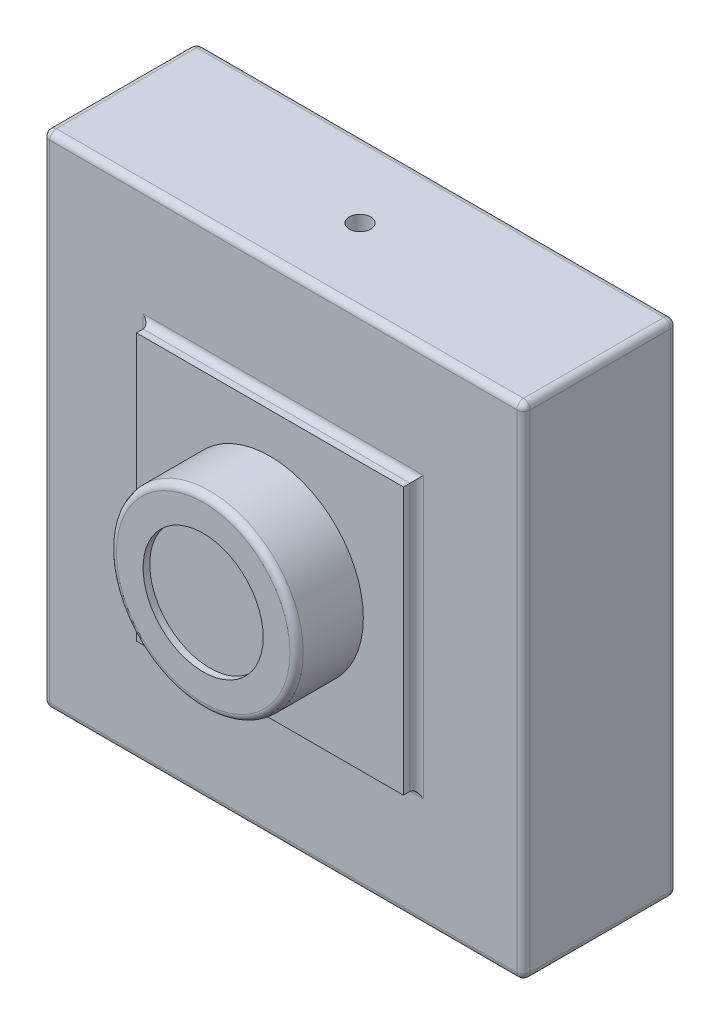
ISO-10303-21;
HEADER;
FILE_DESCRIPTION(('STEP AP214'),'2;1');
FILE_NAME('part.step','',(''),(''),'','','');
FILE_SCHEMA(('AUTOMOTIVE_DESIGN { 1 0 10303 214 1 1 1 1 }'));
ENDSEC;
DATA;
#1=APPLICATION_CONTEXT('core data for automotive mechanical design processes');
#2=APPLICATION_PROTOCOL_DEFINITION('international standard','automotive_design',2000,#1);
#3=PRODUCT_CONTEXT('',#1,'mechanical');
#4=PRODUCT('Part','Part','',(#3));
#5=PRODUCT_RELATED_PRODUCT_CATEGORY('part','',(#4));
#6=PRODUCT_DEFINITION_FORMATION('','',#4);
#7=PRODUCT_DEFINITION_CONTEXT('part definition',#1,'design');
#8=PRODUCT_DEFINITION('design','',#6,#7);
#9=PRODUCT_DEFINITION_SHAPE('','',#8);
#10=(LENGTH_UNIT() NAMED_UNIT(*) SI_UNIT(.MILLI.,.METRE.));
#11=(NAMED_UNIT(*) PLANE_ANGLE_UNIT() SI_UNIT($,.RADIAN.));
#12=(NAMED_UNIT(*) SI_UNIT($,.STERADIAN.) SOLID_ANGLE_UNIT());
#13=UNCERTAINTY_MEASURE_WITH_UNIT(LENGTH_MEASURE(1.E-05),#10,'distance_accuracy_value','');
#14=(GEOMETRIC_REPRESENTATION_CONTEXT(3) GLOBAL_UNCERTAINTY_ASSIGNED_CONTEXT((#13)) GLOBAL_UNIT_ASSIGNED_CONTEXT((#10,
#11,#12)) REPRESENTATION_CONTEXT('',''));
#15=CARTESIAN_POINT('',(0.,0.,0.));
#16=DIRECTION('',(0.,0.,1.));
#17=DIRECTION('',(1.,0.,0.));
#18=AXIS2_PLACEMENT_3D('',#15,#16,#17);
#19=CARTESIAN_POINT('',(-18.,-18.75,11.5));
#20=DIRECTION('',(1.,0.,0.));
#21=DIRECTION('',(0.,0.,-1.));
#22=AXIS2_PLACEMENT_3D('',#19,#20,#21);
#23=PLANE('',#22);
#24=DIRECTION('',(0.,-1.,0.));
#25=VECTOR('',#24,1.);
#26=CARTESIAN_POINT('',(-18.,18.75,11.));
#27=LINE('',#26,#25);
#28=CARTESIAN_POINT('',(-18.,-18.25,11.));
#29=VERTEX_POINT('',#28);
#30=CARTESIAN_POINT('',(-18.,18.25,11.));
#31=VERTEX_POINT('',#30);
#32=EDGE_CURVE('E269',#29,#31,#27,.F.);
#33=ORIENTED_EDGE('',*,*,#32,.T.);
#34=DIRECTION('',(0.,0.,-1.));
#35=VECTOR('',#34,1.);
#36=CARTESIAN_POINT('',(-18.,18.25,11.5));
#37=LINE('',#36,#35);
#38=CARTESIAN_POINT('',(-18.,18.25,0.5));
#39=VERTEX_POINT('',#38);
#40=EDGE_CURVE('E276',#31,#39,#37,.T.);
#41=ORIENTED_EDGE('',*,*,#40,.T.);
#42=DIRECTION('',(0.,-1.,0.));
#43=VECTOR('',#42,1.);
#44=CARTESIAN_POINT('',(-18.,-18.75,0.5));
#45=LINE('',#44,#43);
#46=CARTESIAN_POINT('',(-18.,-18.25,0.5));
#47=VERTEX_POINT('',#46);
#48=EDGE_CURVE('E272',#39,#47,#45,.T.);
#49=ORIENTED_EDGE('',*,*,#48,.T.);
#50=DIRECTION('',(0.,0.,-1.));
#51=VECTOR('',#50,1.);
#52=CARTESIAN_POINT('',(-18.,-18.25,11.5));
#53=LINE('',#52,#51);
#54=EDGE_CURVE('E266',#47,#29,#53,.F.);
#55=ORIENTED_EDGE('',*,*,#54,.T.);
#56=EDGE_LOOP('',(#33,#41,#49,#55));
#57=FACE_BOUND('',#56,.T.);
#58=ADVANCED_FACE('F42',(#57),#23,.F.);
#59=CARTESIAN_POINT('',(18.,-18.75,11.5));
#60=DIRECTION('',(0.,1.,0.));
#61=DIRECTION('',(-1.,0.,0.));
#62=AXIS2_PLACEMENT_3D('',#59,#60,#61);
#63=PLANE('',#62);
#64=CARTESIAN_POINT('',(0.,-18.75,5.75));
#65=DIRECTION('',(0.,-1.,0.));
#66=DIRECTION('',(0.,0.,-1.));
#67=AXIS2_PLACEMENT_3D('',#64,#65,#66);
#68=CIRCLE('',#67,0.79999999999999);
#69=CARTESIAN_POINT('',(0.,-18.75,4.95000000000001));
#70=VERTEX_POINT('',#69);
#71=EDGE_CURVE('E886',#70,#70,#68,.T.);
#72=ORIENTED_EDGE('',*,*,#71,.F.);
#73=EDGE_LOOP('',(#72));
#74=FACE_BOUND('',#73,.T.);
#75=DIRECTION('',(1.,0.,0.));
#76=VECTOR('',#75,1.);
#77=CARTESIAN_POINT('',(18.,-18.75,0.5));
#78=LINE('',#77,#76);
#79=CARTESIAN_POINT('',(-17.5,-18.75,0.5));
#80=VERTEX_POINT('',#79);
#81=CARTESIAN_POINT('',(17.5,-18.75,0.5));
#82=VERTEX_POINT('',#81);
#83=EDGE_CURVE('E220',#80,#82,#78,.T.);
#84=ORIENTED_EDGE('',*,*,#83,.T.);
#85=DIRECTION('',(0.,0.,-1.));
#86=VECTOR('',#85,1.);
#87=CARTESIAN_POINT('',(17.5,-18.75,11.5));
#88=LINE('',#87,#86);
#89=CARTESIAN_POINT('',(17.5,-18.75,11.));
#90=VERTEX_POINT('',#89);
#91=EDGE_CURVE('E224',#82,#90,#88,.F.);
#92=ORIENTED_EDGE('',*,*,#91,.T.);
#93=DIRECTION('',(1.,0.,0.));
#94=VECTOR('',#93,1.);
#95=CARTESIAN_POINT('',(-18.,-18.75,11.));
#96=LINE('',#95,#94);
#97=CARTESIAN_POINT('',(-17.5,-18.75,11.));
#98=VERTEX_POINT('',#97);
#99=EDGE_CURVE('E217',#90,#98,#96,.F.);
#100=ORIENTED_EDGE('',*,*,#99,.T.);
#101=DIRECTION('',(0.,0.,-1.));
#102=VECTOR('',#101,1.);
#103=CARTESIAN_POINT('',(-17.5,-18.75,11.5));
#104=LINE('',#103,#102);
#105=EDGE_CURVE('E214',#98,#80,#104,.T.);
#106=ORIENTED_EDGE('',*,*,#105,.T.);
#107=EDGE_LOOP('',(#84,#92,#100,#106));
#108=FACE_BOUND('',#107,.T.);
#109=ADVANCED_FACE('F451',(#74,#108),#63,.F.);
#110=CARTESIAN_POINT('',(18.,-18.75,11.5));
#111=DIRECTION('',(-1.,0.,0.));
#112=DIRECTION('',(0.,0.,1.));
#113=AXIS2_PLACEMENT_3D('',#110,#111,#112);
#114=PLANE('',#113);
#115=DIRECTION('',(0.,1.,0.));
#116=VECTOR('',#115,1.);
#117=CARTESIAN_POINT('',(18.,-18.75,0.5));
#118=LINE('',#117,#116);
#119=CARTESIAN_POINT('',(18.,-18.25,0.5));
#120=VERTEX_POINT('',#119);
#121=CARTESIAN_POINT('',(18.,18.25,0.5));
#122=VERTEX_POINT('',#121);
#123=EDGE_CURVE('E246',#120,#122,#118,.T.);
#124=ORIENTED_EDGE('',*,*,#123,.T.);
#125=DIRECTION('',(0.,0.,-1.));
#126=VECTOR('',#125,1.);
#127=CARTESIAN_POINT('',(18.,18.25,11.5));
#128=LINE('',#127,#126);
#129=CARTESIAN_POINT('',(18.,18.25,11.));
#130=VERTEX_POINT('',#129);
#131=EDGE_CURVE('E250',#122,#130,#128,.F.);
#132=ORIENTED_EDGE('',*,*,#131,.T.);
#133=DIRECTION('',(0.,1.,0.));
#134=VECTOR('',#133,1.);
#135=CARTESIAN_POINT('',(18.,-18.75,11.));
#136=LINE('',#135,#134);
#137=CARTESIAN_POINT('',(18.,-18.25,11.));
#138=VERTEX_POINT('',#137);
#139=EDGE_CURVE('E243',#130,#138,#136,.F.);
#140=ORIENTED_EDGE('',*,*,#139,.T.);
#141=DIRECTION('',(0.,0.,-1.));
#142=VECTOR('',#141,1.);
#143=CARTESIAN_POINT('',(18.,-18.25,11.5));
#144=LINE('',#143,#142);
#145=EDGE_CURVE('E240',#138,#120,#144,.T.);
#146=ORIENTED_EDGE('',*,*,#145,.T.);
#147=EDGE_LOOP('',(#124,#132,#140,#146));
#148=FACE_BOUND('',#147,.T.);
#149=ADVANCED_FACE('F459',(#148),#114,.F.);
#150=CARTESIAN_POINT('',(18.,18.75,11.5));
#151=DIRECTION('',(0.,-1.,0.));
#152=DIRECTION('',(1.,0.,0.));
#153=AXIS2_PLACEMENT_3D('',#150,#151,#152);
#154=PLANE('',#153);
#155=CARTESIAN_POINT('',(0.,18.75,5.75));
#156=DIRECTION('',(0.,1.,0.));
#157=DIRECTION('',(0.,0.,1.));
#158=AXIS2_PLACEMENT_3D('',#155,#156,#157);
#159=CIRCLE('',#158,0.79999999999999);
#160=CARTESIAN_POINT('',(0.,18.75,6.54999999999999));
#161=VERTEX_POINT('',#160);
#162=EDGE_CURVE('E883',#161,#161,#159,.T.);
#163=ORIENTED_EDGE('',*,*,#162,.F.);
#164=EDGE_LOOP('',(#163));
#165=FACE_BOUND('',#164,.T.);
#166=DIRECTION('',(-1.,0.,0.));
#167=VECTOR('',#166,1.);
#168=CARTESIAN_POINT('',(18.,18.75,0.5));
#169=LINE('',#168,#167);
#170=CARTESIAN_POINT('',(17.5,18.75,0.5));
#171=VERTEX_POINT('',#170);
#172=CARTESIAN_POINT('',(-17.5,18.75,0.5));
#173=VERTEX_POINT('',#172);
#174=EDGE_CURVE('E259',#171,#173,#169,.T.);
#175=ORIENTED_EDGE('',*,*,#174,.T.);
#176=DIRECTION('',(0.,0.,-1.));
#177=VECTOR('',#176,1.);
#178=CARTESIAN_POINT('',(-17.5,18.75,11.5));
#179=LINE('',#178,#177);
#180=CARTESIAN_POINT('',(-17.5,18.75,11.));
#181=VERTEX_POINT('',#180);
#182=EDGE_CURVE('E263',#173,#181,#179,.F.);
#183=ORIENTED_EDGE('',*,*,#182,.T.);
#184=DIRECTION('',(-1.,0.,0.));
#185=VECTOR('',#184,1.);
#186=CARTESIAN_POINT('',(18.,18.75,11.));
#187=LINE('',#186,#185);
#188=CARTESIAN_POINT('',(17.5,18.75,11.));
#189=VERTEX_POINT('',#188);
#190=EDGE_CURVE('E256',#181,#189,#187,.F.);
#191=ORIENTED_EDGE('',*,*,#190,.T.);
#192=DIRECTION('',(0.,0.,-1.));
#193=VECTOR('',#192,1.);
#194=CARTESIAN_POINT('',(17.5,18.75,11.5));
#195=LINE('',#194,#193);
#196=EDGE_CURVE('E253',#189,#171,#195,.T.);
#197=ORIENTED_EDGE('',*,*,#196,.T.);
#198=EDGE_LOOP('',(#175,#183,#191,#197));
#199=FACE_BOUND('',#198,.T.);
#200=ADVANCED_FACE('F765',(#165,#199),#154,.F.);
#201=CARTESIAN_POINT('',(0.,0.,11.5));
#202=DIRECTION('',(0.,0.,1.));
#203=DIRECTION('',(1.,0.,0.));
#204=AXIS2_PLACEMENT_3D('',#201,#202,#203);
#205=PLANE('',#204);
#206=DIRECTION('',(0.,1.,0.));
#207=VECTOR('',#206,1.);
#208=CARTESIAN_POINT('',(17.5,18.75,11.5));
#209=LINE('',#208,#207);
#210=CARTESIAN_POINT('',(17.5,-18.25,11.5));
#211=VERTEX_POINT('',#210);
#212=CARTESIAN_POINT('',(17.5,18.25,11.5));
#213=VERTEX_POINT('',#212);
#214=EDGE_CURVE('E298',#211,#213,#209,.T.);
#215=ORIENTED_EDGE('',*,*,#214,.T.);
#216=DIRECTION('',(-1.,0.,0.));
#217=VECTOR('',#216,1.);
#218=CARTESIAN_POINT('',(-18.,18.25,11.5));
#219=LINE('',#218,#217);
#220=CARTESIAN_POINT('',(-17.5,18.25,11.5));
#221=VERTEX_POINT('',#220);
#222=EDGE_CURVE('E301',#213,#221,#219,.T.);
#223=ORIENTED_EDGE('',*,*,#222,.T.);
#224=DIRECTION('',(0.,-1.,0.));
#225=VECTOR('',#224,1.);
#226=CARTESIAN_POINT('',(-17.5,-18.75,11.5));
#227=LINE('',#226,#225);
#228=CARTESIAN_POINT('',(-17.5,-18.25,11.5));
#229=VERTEX_POINT('',#228);
#230=EDGE_CURVE('E292',#221,#229,#227,.T.);
#231=ORIENTED_EDGE('',*,*,#230,.T.);
#232=DIRECTION('',(1.,0.,0.));
#233=VECTOR('',#232,1.);
#234=CARTESIAN_POINT('',(18.,-18.25,11.5));
#235=LINE('',#234,#233);
#236=EDGE_CURVE('E295',#229,#211,#235,.T.);
#237=ORIENTED_EDGE('',*,*,#236,.T.);
#238=EDGE_LOOP('',(#215,#223,#231,#237));
#239=FACE_BOUND('',#238,.T.);
#240=DIRECTION('',(0.,1.,0.));
#241=VECTOR('',#240,1.);
#242=CARTESIAN_POINT('',(10.5,0.,11.5));
#243=LINE('',#242,#241);
#244=CARTESIAN_POINT('',(10.5,10.5,11.5));
#245=VERTEX_POINT('',#244);
#246=CARTESIAN_POINT('',(10.5,-10.5,11.5));
#247=VERTEX_POINT('',#246);
#248=EDGE_CURVE('E285',#245,#247,#243,.F.);
#249=ORIENTED_EDGE('',*,*,#248,.T.);
#250=DIRECTION('',(1.,0.,0.));
#251=VECTOR('',#250,1.);
#252=CARTESIAN_POINT('',(0.,-10.5,11.5));
#253=LINE('',#252,#251);
#254=CARTESIAN_POINT('',(-10.5,-10.5,11.5));
#255=VERTEX_POINT('',#254);
#256=EDGE_CURVE('E288',#247,#255,#253,.F.);
#257=ORIENTED_EDGE('',*,*,#256,.T.);
#258=DIRECTION('',(0.,-1.,0.));
#259=VECTOR('',#258,1.);
#260=CARTESIAN_POINT('',(-10.5,0.,11.5));
#261=LINE('',#260,#259);
#262=CARTESIAN_POINT('',(-10.5,10.5,11.5));
#263=VERTEX_POINT('',#262);
#264=EDGE_CURVE('E279',#255,#263,#261,.F.);
#265=ORIENTED_EDGE('',*,*,#264,.T.);
#266=DIRECTION('',(-1.,0.,0.));
#267=VECTOR('',#266,1.);
#268=CARTESIAN_POINT('',(0.,10.5,11.5));
#269=LINE('',#268,#267);
#270=EDGE_CURVE('E282',#263,#245,#269,.F.);
#271=ORIENTED_EDGE('',*,*,#270,.T.);
#272=EDGE_LOOP('',(#249,#257,#265,#271));
#273=FACE_BOUND('',#272,.T.);
#274=ADVANCED_FACE('F423',(#239,#273),#205,.T.);
#275=CARTESIAN_POINT('',(0.,0.,0.));
#276=DIRECTION('',(0.,0.,1.));
#277=DIRECTION('',(1.,0.,0.));
#278=AXIS2_PLACEMENT_3D('',#275,#276,#277);
#279=PLANE('',#278);
#280=DIRECTION('',(0.,1.,0.));
#281=VECTOR('',#280,1.);
#282=CARTESIAN_POINT('',(17.5,0.,0.));
#283=LINE('',#282,#281);
#284=CARTESIAN_POINT('',(17.5,18.25,0.));
#285=VERTEX_POINT('',#284);
#286=CARTESIAN_POINT('',(17.5,-18.25,0.));
#287=VERTEX_POINT('',#286);
#288=EDGE_CURVE('E233',#285,#287,#283,.F.);
#289=ORIENTED_EDGE('',*,*,#288,.T.);
#290=DIRECTION('',(1.,0.,0.));
#291=VECTOR('',#290,1.);
#292=CARTESIAN_POINT('',(0.,-18.25,0.));
#293=LINE('',#292,#291);
#294=CARTESIAN_POINT('',(-17.5,-18.25,0.));
#295=VERTEX_POINT('',#294);
#296=EDGE_CURVE('E236',#287,#295,#293,.F.);
#297=ORIENTED_EDGE('',*,*,#296,.T.);
#298=DIRECTION('',(0.,-1.,0.));
#299=VECTOR('',#298,1.);
#300=CARTESIAN_POINT('',(-17.5,0.,0.));
#301=LINE('',#300,#299);
#302=CARTESIAN_POINT('',(-17.5,18.25,0.));
#303=VERTEX_POINT('',#302);
#304=EDGE_CURVE('E227',#295,#303,#301,.F.);
#305=ORIENTED_EDGE('',*,*,#304,.T.);
#306=DIRECTION('',(-1.,0.,0.));
#307=VECTOR('',#306,1.);
#308=CARTESIAN_POINT('',(0.,18.25,0.));
#309=LINE('',#308,#307);
#310=EDGE_CURVE('E230',#303,#285,#309,.F.);
#311=ORIENTED_EDGE('',*,*,#310,.T.);
#312=EDGE_LOOP('',(#289,#297,#305,#311));
#313=FACE_BOUND('',#312,.T.);
#314=ADVANCED_FACE('F791',(#313),#279,.F.);
#315=CARTESIAN_POINT('',(-10.,-10.,12.5));
#316=DIRECTION('',(1.,0.,0.));
#317=DIRECTION('',(0.,0.,-1.));
#318=AXIS2_PLACEMENT_3D('',#315,#316,#317);
#319=PLANE('',#318);
#320=DIRECTION('',(0.,0.,-1.));
#321=VECTOR('',#320,1.);
#322=CARTESIAN_POINT('',(-10.,9.99999999999999,12.5));
#323=LINE('',#322,#321);
#324=CARTESIAN_POINT('',(-10.,9.99999999999999,12.5));
#325=VERTEX_POINT('',#324);
#326=CARTESIAN_POINT('',(-10.,9.99999999999999,12.));
#327=VERTEX_POINT('',#326);
#328=EDGE_CURVE('E434',#325,#327,#323,.T.);
#329=ORIENTED_EDGE('',*,*,#328,.T.);
#330=DIRECTION('',(0.,-1.,0.));
#331=VECTOR('',#330,1.);
#332=CARTESIAN_POINT('',(-10.,-10.,12.));
#333=LINE('',#332,#331);
#334=CARTESIAN_POINT('',(-10.,-10.,12.));
#335=VERTEX_POINT('',#334);
#336=EDGE_CURVE('E11',#327,#335,#333,.T.);
#337=ORIENTED_EDGE('',*,*,#336,.T.);
#338=DIRECTION('',(0.,0.,-1.));
#339=VECTOR('',#338,1.);
#340=CARTESIAN_POINT('',(-10.,-10.,12.5));
#341=LINE('',#340,#339);
#342=CARTESIAN_POINT('',(-10.,-10.,12.5));
#343=VERTEX_POINT('',#342);
#344=EDGE_CURVE('E176',#343,#335,#341,.T.);
#345=ORIENTED_EDGE('',*,*,#344,.F.);
#346=DIRECTION('',(0.,-1.,0.));
#347=VECTOR('',#346,1.);
#348=CARTESIAN_POINT('',(-10.,-10.,12.5));
#349=LINE('',#348,#347);
#350=EDGE_CURVE('E183',#325,#343,#349,.T.);
#351=ORIENTED_EDGE('',*,*,#350,.F.);
#352=EDGE_LOOP('',(#329,#337,#345,#351));
#353=FACE_BOUND('',#352,.T.);
#354=ADVANCED_FACE('F193',(#353),#319,.F.);
#355=CARTESIAN_POINT('',(10.,-10.,12.5));
#356=DIRECTION('',(0.,1.,0.));
#357=DIRECTION('',(-1.,0.,0.));
#358=AXIS2_PLACEMENT_3D('',#355,#356,#357);
#359=PLANE('',#358);
#360=ORIENTED_EDGE('',*,*,#344,.T.);
#361=DIRECTION('',(1.,0.,0.));
#362=VECTOR('',#361,1.);
#363=CARTESIAN_POINT('',(10.,-10.,12.));
#364=LINE('',#363,#362);
#365=CARTESIAN_POINT('',(10.,-10.,12.));
#366=VERTEX_POINT('',#365);
#367=EDGE_CURVE('E305',#335,#366,#364,.T.);
#368=ORIENTED_EDGE('',*,*,#367,.T.);
#369=DIRECTION('',(0.,0.,-1.));
#370=VECTOR('',#369,1.);
#371=CARTESIAN_POINT('',(10.,-10.,12.5));
#372=LINE('',#371,#370);
#373=CARTESIAN_POINT('',(10.,-10.,12.5));
#374=VERTEX_POINT('',#373);
#375=EDGE_CURVE('E178',#374,#366,#372,.T.);
#376=ORIENTED_EDGE('',*,*,#375,.F.);
#377=DIRECTION('',(1.,0.,0.));
#378=VECTOR('',#377,1.);
#379=CARTESIAN_POINT('',(10.,-10.,12.5));
#380=LINE('',#379,#378);
#381=EDGE_CURVE('E171',#343,#374,#380,.T.);
#382=ORIENTED_EDGE('',*,*,#381,.F.);
#383=EDGE_LOOP('',(#360,#368,#376,#382));
#384=FACE_BOUND('',#383,.T.);
#385=ADVANCED_FACE('F173',(#384),#359,.F.);
#386=CARTESIAN_POINT('',(10.,-10.,12.5));
#387=DIRECTION('',(-1.,0.,0.));
#388=DIRECTION('',(0.,0.,1.));
#389=AXIS2_PLACEMENT_3D('',#386,#387,#388);
#390=PLANE('',#389);
#391=ORIENTED_EDGE('',*,*,#375,.T.);
#392=DIRECTION('',(0.,1.,0.));
#393=VECTOR('',#392,1.);
#394=CARTESIAN_POINT('',(10.,-10.,12.));
#395=LINE('',#394,#393);
#396=CARTESIAN_POINT('',(10.,10.,12.));
#397=VERTEX_POINT('',#396);
#398=EDGE_CURVE('E67',#366,#397,#395,.T.);
#399=ORIENTED_EDGE('',*,*,#398,.T.);
#400=DIRECTION('',(0.,0.,-1.));
#401=VECTOR('',#400,1.);
#402=CARTESIAN_POINT('',(10.,10.,12.5));
#403=LINE('',#402,#401);
#404=CARTESIAN_POINT('',(10.,10.,12.5));
#405=VERTEX_POINT('',#404);
#406=EDGE_CURVE('E203',#405,#397,#403,.T.);
#407=ORIENTED_EDGE('',*,*,#406,.F.);
#408=DIRECTION('',(0.,1.,0.));
#409=VECTOR('',#408,1.);
#410=CARTESIAN_POINT('',(10.,-10.,12.5));
#411=LINE('',#410,#409);
#412=EDGE_CURVE('E182',#374,#405,#411,.T.);
#413=ORIENTED_EDGE('',*,*,#412,.F.);
#414=EDGE_LOOP('',(#391,#399,#407,#413));
#415=FACE_BOUND('',#414,.T.);
#416=ADVANCED_FACE('F430',(#415),#390,.F.);
#417=CARTESIAN_POINT('',(10.,10.,12.5));
#418=DIRECTION('',(0.,-1.,0.));
#419=DIRECTION('',(1.,0.,0.));
#420=AXIS2_PLACEMENT_3D('',#417,#418,#419);
#421=PLANE('',#420);
#422=ORIENTED_EDGE('',*,*,#406,.T.);
#423=DIRECTION('',(-1.,0.,0.));
#424=VECTOR('',#423,1.);
#425=CARTESIAN_POINT('',(10.,10.,12.));
#426=LINE('',#425,#424);
#427=EDGE_CURVE('E52',#397,#327,#426,.T.);
#428=ORIENTED_EDGE('',*,*,#427,.T.);
#429=ORIENTED_EDGE('',*,*,#328,.F.);
#430=DIRECTION('',(-1.,0.,0.));
#431=VECTOR('',#430,1.);
#432=CARTESIAN_POINT('',(10.,10.,12.5));
#433=LINE('',#432,#431);
#434=EDGE_CURVE('E188',#405,#325,#433,.T.);
#435=ORIENTED_EDGE('',*,*,#434,.F.);
#436=EDGE_LOOP('',(#422,#428,#429,#435));
#437=FACE_BOUND('',#436,.T.);
#438=ADVANCED_FACE('F439',(#437),#421,.F.);
#439=CARTESIAN_POINT('',(0.,0.,12.5));
#440=DIRECTION('',(0.,0.,1.));
#441=DIRECTION('',(1.,0.,0.));
#442=AXIS2_PLACEMENT_3D('',#439,#440,#441);
#443=PLANE('',#442);
#444=CARTESIAN_POINT('',(0.,0.,12.5));
#445=DIRECTION('',(0.,0.,1.));
#446=DIRECTION('',(1.,0.,0.));
#447=AXIS2_PLACEMENT_3D('',#444,#445,#446);
#448=CIRCLE('',#447,7.);
#449=CARTESIAN_POINT('',(7.,0.,12.5));
#450=VERTEX_POINT('',#449);
#451=EDGE_CURVE('E196',#450,#450,#448,.T.);
#452=ORIENTED_EDGE('',*,*,#451,.F.);
#453=EDGE_LOOP('',(#452));
#454=FACE_BOUND('',#453,.T.);
#455=ORIENTED_EDGE('',*,*,#350,.T.);
#456=ORIENTED_EDGE('',*,*,#381,.T.);
#457=ORIENTED_EDGE('',*,*,#412,.T.);
#458=ORIENTED_EDGE('',*,*,#434,.T.);
#459=EDGE_LOOP('',(#455,#456,#457,#458));
#460=FACE_BOUND('',#459,.T.);
#461=ADVANCED_FACE('F186',(#454,#460),#443,.T.);
#462=CARTESIAN_POINT('',(0.,0.,17.5));
#463=DIRECTION('',(0.,0.,-1.));
#464=DIRECTION('',(-1.,0.,0.));
#465=AXIS2_PLACEMENT_3D('',#462,#463,#464);
#466=CYLINDRICAL_SURFACE('',#465,7.);
#467=CARTESIAN_POINT('',(0.,0.,17.));
#468=DIRECTION('',(0.,0.,1.));
#469=DIRECTION('',(1.,0.,0.));
#470=AXIS2_PLACEMENT_3D('',#467,#468,#469);
#471=CIRCLE('',#470,7.);
#472=CARTESIAN_POINT('',(7.,0.,17.));
#473=VERTEX_POINT('',#472);
#474=EDGE_CURVE('E210',#473,#473,#471,.F.);
#475=ORIENTED_EDGE('',*,*,#474,.T.);
#476=EDGE_LOOP('',(#475));
#477=FACE_BOUND('',#476,.T.);
#478=ORIENTED_EDGE('',*,*,#451,.T.);
#479=EDGE_LOOP('',(#478));
#480=FACE_BOUND('',#479,.T.);
#481=ADVANCED_FACE('F446',(#477,#480),#466,.T.);
#482=CARTESIAN_POINT('',(0.,0.,17.5));
#483=DIRECTION('',(0.,0.,1.));
#484=DIRECTION('',(1.,0.,0.));
#485=AXIS2_PLACEMENT_3D('',#482,#483,#484);
#486=PLANE('',#485);
#487=CARTESIAN_POINT('',(0.,0.,17.5));
#488=DIRECTION('',(0.,0.,1.));
#489=DIRECTION('',(1.,0.,0.));
#490=AXIS2_PLACEMENT_3D('',#487,#488,#489);
#491=CIRCLE('',#490,4.5);
#492=CARTESIAN_POINT('',(4.5,0.,17.5));
#493=VERTEX_POINT('',#492);
#494=EDGE_CURVE('E890',#493,#493,#491,.T.);
#495=ORIENTED_EDGE('',*,*,#494,.F.);
#496=EDGE_LOOP('',(#495));
#497=FACE_BOUND('',#496,.T.);
#498=CARTESIAN_POINT('',(0.,0.,17.5));
#499=DIRECTION('',(0.,0.,1.));
#500=DIRECTION('',(1.,0.,0.));
#501=AXIS2_PLACEMENT_3D('',#498,#499,#500);
#502=CIRCLE('',#501,6.5);
#503=CARTESIAN_POINT('',(6.5,0.,17.5));
#504=VERTEX_POINT('',#503);
#505=EDGE_CURVE('E201',#504,#504,#502,.T.);
#506=ORIENTED_EDGE('',*,*,#505,.T.);
#507=EDGE_LOOP('',(#506));
#508=FACE_BOUND('',#507,.T.);
#509=ADVANCED_FACE('F468',(#497,#508),#486,.T.);
#510=CARTESIAN_POINT('',(0.,0.,17.));
#511=DIRECTION('',(0.,0.,1.));
#512=DIRECTION('',(1.,0.,0.));
#513=AXIS2_PLACEMENT_3D('',#510,#511,#512);
#514=TOROIDAL_SURFACE('',#513,6.5,0.5);
#515=ORIENTED_EDGE('',*,*,#474,.F.);
#516=EDGE_LOOP('',(#515));
#517=FACE_BOUND('',#516,.T.);
#518=ORIENTED_EDGE('',*,*,#505,.F.);
#519=EDGE_LOOP('',(#518));
#520=FACE_BOUND('',#519,.T.);
#521=ADVANCED_FACE('F464',(#517,#520),#514,.T.);
#522=CARTESIAN_POINT('',(0.,18.25,11.));
#523=DIRECTION('',(1.,0.,0.));
#524=DIRECTION('',(0.,1.,0.));
#525=AXIS2_PLACEMENT_3D('',#522,#523,#524);
#526=CYLINDRICAL_SURFACE('',#525,0.5);
#527=CARTESIAN_POINT('',(-17.5,18.25,11.));
#528=DIRECTION('',(-1.,0.,0.));
#529=DIRECTION('',(0.,0.,1.));
#530=AXIS2_PLACEMENT_3D('',#527,#528,#529);
#531=CIRCLE('',#530,0.5);
#532=EDGE_CURVE('E191',#221,#181,#531,.T.);
#533=ORIENTED_EDGE('',*,*,#532,.F.);
#534=ORIENTED_EDGE('',*,*,#222,.F.);
#535=CARTESIAN_POINT('',(17.5,18.25,11.));
#536=DIRECTION('',(1.,0.,0.));
#537=DIRECTION('',(0.,0.,-1.));
#538=AXIS2_PLACEMENT_3D('',#535,#536,#537);
#539=CIRCLE('',#538,0.5);
#540=EDGE_CURVE('E395',#189,#213,#539,.T.);
#541=ORIENTED_EDGE('',*,*,#540,.F.);
#542=ORIENTED_EDGE('',*,*,#190,.F.);
#543=EDGE_LOOP('',(#533,#534,#541,#542));
#544=FACE_BOUND('',#543,.T.);
#545=ADVANCED_FACE('F467',(#544),#526,.T.);
#546=CARTESIAN_POINT('',(-17.5,18.25,11.));
#547=DIRECTION('',(0.,0.,1.));
#548=DIRECTION('',(1.,0.,0.));
#549=AXIS2_PLACEMENT_3D('',#546,#547,#548);
#550=SPHERICAL_SURFACE('',#549,0.5);
#551=CARTESIAN_POINT('',(-17.5,18.25,11.));
#552=DIRECTION('',(0.,1.,0.));
#553=DIRECTION('',(0.,0.,1.));
#554=AXIS2_PLACEMENT_3D('',#551,#552,#553);
#555=CIRCLE('',#554,0.5);
#556=EDGE_CURVE('E387',#221,#31,#555,.F.);
#557=ORIENTED_EDGE('',*,*,#556,.F.);
#558=ORIENTED_EDGE('',*,*,#532,.T.);
#559=CARTESIAN_POINT('',(-17.5,18.25,11.));
#560=DIRECTION('',(0.,0.,1.));
#561=DIRECTION('',(1.,0.,0.));
#562=AXIS2_PLACEMENT_3D('',#559,#560,#561);
#563=CIRCLE('',#562,0.5);
#564=EDGE_CURVE('E391',#31,#181,#563,.F.);
#565=ORIENTED_EDGE('',*,*,#564,.F.);
#566=EDGE_LOOP('',(#557,#558,#565));
#567=FACE_BOUND('',#566,.T.);
#568=ADVANCED_FACE('F541',(#567),#550,.T.);
#569=CARTESIAN_POINT('',(17.5,18.25,11.));
#570=DIRECTION('',(0.,0.,1.));
#571=DIRECTION('',(1.,0.,0.));
#572=AXIS2_PLACEMENT_3D('',#569,#570,#571);
#573=SPHERICAL_SURFACE('',#572,0.5);
#574=CARTESIAN_POINT('',(17.5,18.25,11.));
#575=DIRECTION('',(0.,0.,1.));
#576=DIRECTION('',(1.,0.,0.));
#577=AXIS2_PLACEMENT_3D('',#574,#575,#576);
#578=CIRCLE('',#577,0.5);
#579=EDGE_CURVE('E379',#189,#130,#578,.F.);
#580=ORIENTED_EDGE('',*,*,#579,.F.);
#581=ORIENTED_EDGE('',*,*,#540,.T.);
#582=CARTESIAN_POINT('',(17.5,18.25,11.));
#583=DIRECTION('',(0.,1.,0.));
#584=DIRECTION('',(0.,0.,1.));
#585=AXIS2_PLACEMENT_3D('',#582,#583,#584);
#586=CIRCLE('',#585,0.5);
#587=EDGE_CURVE('E383',#130,#213,#586,.F.);
#588=ORIENTED_EDGE('',*,*,#587,.F.);
#589=EDGE_LOOP('',(#580,#581,#588));
#590=FACE_BOUND('',#589,.T.);
#591=ADVANCED_FACE('F537',(#590),#573,.T.);
#592=CARTESIAN_POINT('',(-17.5,18.25,11.5));
#593=DIRECTION('',(0.,0.,-1.));
#594=DIRECTION('',(-1.,0.,0.));
#595=AXIS2_PLACEMENT_3D('',#592,#593,#594);
#596=CYLINDRICAL_SURFACE('',#595,0.5);
#597=ORIENTED_EDGE('',*,*,#564,.T.);
#598=ORIENTED_EDGE('',*,*,#182,.F.);
#599=CARTESIAN_POINT('',(-17.5,18.25,0.5));
#600=DIRECTION('',(0.,0.,-1.));
#601=DIRECTION('',(-1.,0.,0.));
#602=AXIS2_PLACEMENT_3D('',#599,#600,#601);
#603=CIRCLE('',#602,0.5);
#604=EDGE_CURVE('E372',#39,#173,#603,.T.);
#605=ORIENTED_EDGE('',*,*,#604,.F.);
#606=ORIENTED_EDGE('',*,*,#40,.F.);
#607=EDGE_LOOP('',(#597,#598,#605,#606));
#608=FACE_BOUND('',#607,.T.);
#609=ADVANCED_FACE('F533',(#608),#596,.T.);
#610=CARTESIAN_POINT('',(-17.5,0.,11.));
#611=DIRECTION('',(0.,1.,0.));
#612=DIRECTION('',(0.,0.,1.));
#613=AXIS2_PLACEMENT_3D('',#610,#611,#612);
#614=CYLINDRICAL_SURFACE('',#613,0.5);
#615=ORIENTED_EDGE('',*,*,#556,.T.);
#616=ORIENTED_EDGE('',*,*,#32,.F.);
#617=CARTESIAN_POINT('',(-17.5,-18.25,11.));
#618=DIRECTION('',(0.,-1.,0.));
#619=DIRECTION('',(0.,0.,-1.));
#620=AXIS2_PLACEMENT_3D('',#617,#618,#619);
#621=CIRCLE('',#620,0.5);
#622=EDGE_CURVE('E368',#229,#29,#621,.T.);
#623=ORIENTED_EDGE('',*,*,#622,.F.);
#624=ORIENTED_EDGE('',*,*,#230,.F.);
#625=EDGE_LOOP('',(#615,#616,#623,#624));
#626=FACE_BOUND('',#625,.T.);
#627=ADVANCED_FACE('F529',(#626),#614,.T.);
#628=CARTESIAN_POINT('',(0.,-18.25,11.));
#629=DIRECTION('',(-1.,0.,0.));
#630=DIRECTION('',(0.,-1.,0.));
#631=AXIS2_PLACEMENT_3D('',#628,#629,#630);
#632=CYLINDRICAL_SURFACE('',#631,0.5);
#633=CARTESIAN_POINT('',(17.5,-18.25,11.));
#634=DIRECTION('',(1.,0.,0.));
#635=DIRECTION('',(0.,0.,-1.));
#636=AXIS2_PLACEMENT_3D('',#633,#634,#635);
#637=CIRCLE('',#636,0.5);
#638=EDGE_CURVE('E360',#211,#90,#637,.T.);
#639=ORIENTED_EDGE('',*,*,#638,.F.);
#640=ORIENTED_EDGE('',*,*,#236,.F.);
#641=CARTESIAN_POINT('',(-17.5,-18.25,11.));
#642=DIRECTION('',(-1.,0.,0.));
#643=DIRECTION('',(0.,0.,1.));
#644=AXIS2_PLACEMENT_3D('',#641,#642,#643);
#645=CIRCLE('',#644,0.5);
#646=EDGE_CURVE('E364',#98,#229,#645,.T.);
#647=ORIENTED_EDGE('',*,*,#646,.F.);
#648=ORIENTED_EDGE('',*,*,#99,.F.);
#649=EDGE_LOOP('',(#639,#640,#647,#648));
#650=FACE_BOUND('',#649,.T.);
#651=ADVANCED_FACE('F525',(#650),#632,.T.);
#652=CARTESIAN_POINT('',(17.5,0.,11.));
#653=DIRECTION('',(0.,-1.,0.));
#654=DIRECTION('',(0.,0.,-1.));
#655=AXIS2_PLACEMENT_3D('',#652,#653,#654);
#656=CYLINDRICAL_SURFACE('',#655,0.5);
#657=ORIENTED_EDGE('',*,*,#587,.T.);
#658=ORIENTED_EDGE('',*,*,#214,.F.);
#659=CARTESIAN_POINT('',(17.5,-18.25,11.));
#660=DIRECTION('',(0.,-1.,0.));
#661=DIRECTION('',(0.,0.,-1.));
#662=AXIS2_PLACEMENT_3D('',#659,#660,#661);
#663=CIRCLE('',#662,0.5);
#664=EDGE_CURVE('E356',#138,#211,#663,.T.);
#665=ORIENTED_EDGE('',*,*,#664,.F.);
#666=ORIENTED_EDGE('',*,*,#139,.F.);
#667=EDGE_LOOP('',(#657,#658,#665,#666));
#668=FACE_BOUND('',#667,.T.);
#669=ADVANCED_FACE('F521',(#668),#656,.T.);
#670=CARTESIAN_POINT('',(17.5,18.25,11.5));
#671=DIRECTION('',(0.,0.,-1.));
#672=DIRECTION('',(-1.,0.,0.));
#673=AXIS2_PLACEMENT_3D('',#670,#671,#672);
#674=CYLINDRICAL_SURFACE('',#673,0.5);
#675=ORIENTED_EDGE('',*,*,#579,.T.);
#676=ORIENTED_EDGE('',*,*,#131,.F.);
#677=CARTESIAN_POINT('',(17.5,18.25,0.5));
#678=DIRECTION('',(0.,0.,-1.));
#679=DIRECTION('',(-1.,0.,0.));
#680=AXIS2_PLACEMENT_3D('',#677,#678,#679);
#681=CIRCLE('',#680,0.5);
#682=EDGE_CURVE('E352',#171,#122,#681,.T.);
#683=ORIENTED_EDGE('',*,*,#682,.F.);
#684=ORIENTED_EDGE('',*,*,#196,.F.);
#685=EDGE_LOOP('',(#675,#676,#683,#684));
#686=FACE_BOUND('',#685,.T.);
#687=ADVANCED_FACE('F517',(#686),#674,.T.);
#688=CARTESIAN_POINT('',(18.,18.25,0.5));
#689=DIRECTION('',(-1.,0.,0.));
#690=DIRECTION('',(0.,-1.,0.));
#691=AXIS2_PLACEMENT_3D('',#688,#689,#690);
#692=CYLINDRICAL_SURFACE('',#691,0.5);
#693=CARTESIAN_POINT('',(-17.5,18.25,0.5));
#694=DIRECTION('',(-1.,0.,0.));
#695=DIRECTION('',(0.,0.,1.));
#696=AXIS2_PLACEMENT_3D('',#693,#694,#695);
#697=CIRCLE('',#696,0.5);
#698=EDGE_CURVE('E375',#173,#303,#697,.T.);
#699=ORIENTED_EDGE('',*,*,#698,.F.);
#700=ORIENTED_EDGE('',*,*,#174,.F.);
#701=CARTESIAN_POINT('',(17.5,18.25,0.5));
#702=DIRECTION('',(1.,0.,0.));
#703=DIRECTION('',(0.,0.,-1.));
#704=AXIS2_PLACEMENT_3D('',#701,#702,#703);
#705=CIRCLE('',#704,0.5);
#706=EDGE_CURVE('E348',#285,#171,#705,.T.);
#707=ORIENTED_EDGE('',*,*,#706,.F.);
#708=ORIENTED_EDGE('',*,*,#310,.F.);
#709=EDGE_LOOP('',(#699,#700,#707,#708));
#710=FACE_BOUND('',#709,.T.);
#711=ADVANCED_FACE('F513',(#710),#692,.T.);
#712=CARTESIAN_POINT('',(-17.5,18.25,0.5));
#713=DIRECTION('',(0.,0.,1.));
#714=DIRECTION('',(1.,0.,0.));
#715=AXIS2_PLACEMENT_3D('',#712,#713,#714);
#716=SPHERICAL_SURFACE('',#715,0.5);
#717=ORIENTED_EDGE('',*,*,#604,.T.);
#718=ORIENTED_EDGE('',*,*,#698,.T.);
#719=CARTESIAN_POINT('',(-17.5,18.25,0.5));
#720=DIRECTION('',(0.,1.,0.));
#721=DIRECTION('',(-1.,0.,0.));
#722=AXIS2_PLACEMENT_3D('',#719,#720,#721);
#723=CIRCLE('',#722,0.5);
#724=EDGE_CURVE('E344',#39,#303,#723,.F.);
#725=ORIENTED_EDGE('',*,*,#724,.F.);
#726=EDGE_LOOP('',(#717,#718,#725));
#727=FACE_BOUND('',#726,.T.);
#728=ADVANCED_FACE('F509',(#727),#716,.T.);
#729=CARTESIAN_POINT('',(-17.5,-18.25,11.));
#730=DIRECTION('',(0.,0.,1.));
#731=DIRECTION('',(1.,0.,0.));
#732=AXIS2_PLACEMENT_3D('',#729,#730,#731);
#733=SPHERICAL_SURFACE('',#732,0.5);
#734=ORIENTED_EDGE('',*,*,#646,.T.);
#735=ORIENTED_EDGE('',*,*,#622,.T.);
#736=CARTESIAN_POINT('',(-17.5,-18.25,11.));
#737=DIRECTION('',(0.,0.,1.));
#738=DIRECTION('',(1.,0.,0.));
#739=AXIS2_PLACEMENT_3D('',#736,#737,#738);
#740=CIRCLE('',#739,0.5);
#741=EDGE_CURVE('E340',#98,#29,#740,.F.);
#742=ORIENTED_EDGE('',*,*,#741,.F.);
#743=EDGE_LOOP('',(#734,#735,#742));
#744=FACE_BOUND('',#743,.T.);
#745=ADVANCED_FACE('F505',(#744),#733,.T.);
#746=CARTESIAN_POINT('',(17.5,-18.25,11.));
#747=DIRECTION('',(0.,0.,1.));
#748=DIRECTION('',(1.,0.,0.));
#749=AXIS2_PLACEMENT_3D('',#746,#747,#748);
#750=SPHERICAL_SURFACE('',#749,0.5);
#751=ORIENTED_EDGE('',*,*,#664,.T.);
#752=ORIENTED_EDGE('',*,*,#638,.T.);
#753=CARTESIAN_POINT('',(17.5,-18.25,11.));
#754=DIRECTION('',(0.,0.,1.));
#755=DIRECTION('',(1.,0.,0.));
#756=AXIS2_PLACEMENT_3D('',#753,#754,#755);
#757=CIRCLE('',#756,0.5);
#758=EDGE_CURVE('E336',#138,#90,#757,.F.);
#759=ORIENTED_EDGE('',*,*,#758,.F.);
#760=EDGE_LOOP('',(#751,#752,#759));
#761=FACE_BOUND('',#760,.T.);
#762=ADVANCED_FACE('F501',(#761),#750,.T.);
#763=CARTESIAN_POINT('',(17.5,18.25,0.5));
#764=DIRECTION('',(0.,0.,1.));
#765=DIRECTION('',(1.,0.,0.));
#766=AXIS2_PLACEMENT_3D('',#763,#764,#765);
#767=SPHERICAL_SURFACE('',#766,0.5);
#768=ORIENTED_EDGE('',*,*,#706,.T.);
#769=ORIENTED_EDGE('',*,*,#682,.T.);
#770=CARTESIAN_POINT('',(17.5,18.25,0.5));
#771=DIRECTION('',(0.,1.,0.));
#772=DIRECTION('',(0.,0.,1.));
#773=AXIS2_PLACEMENT_3D('',#770,#771,#772);
#774=CIRCLE('',#773,0.5);
#775=EDGE_CURVE('E333',#285,#122,#774,.F.);
#776=ORIENTED_EDGE('',*,*,#775,.F.);
#777=EDGE_LOOP('',(#768,#769,#776));
#778=FACE_BOUND('',#777,.T.);
#779=ADVANCED_FACE('F497',(#778),#767,.T.);
#780=CARTESIAN_POINT('',(-17.5,-18.75,0.5));
#781=DIRECTION('',(0.,-1.,0.));
#782=DIRECTION('',(0.,0.,-1.));
#783=AXIS2_PLACEMENT_3D('',#780,#781,#782);
#784=CYLINDRICAL_SURFACE('',#783,0.5);
#785=ORIENTED_EDGE('',*,*,#724,.T.);
#786=ORIENTED_EDGE('',*,*,#304,.F.);
#787=CARTESIAN_POINT('',(-17.5,-18.25,0.5));
#788=DIRECTION('',(0.,-1.,0.));
#789=DIRECTION('',(0.,0.,-1.));
#790=AXIS2_PLACEMENT_3D('',#787,#788,#789);
#791=CIRCLE('',#790,0.5);
#792=EDGE_CURVE('E329',#47,#295,#791,.T.);
#793=ORIENTED_EDGE('',*,*,#792,.F.);
#794=ORIENTED_EDGE('',*,*,#48,.F.);
#795=EDGE_LOOP('',(#785,#786,#793,#794));
#796=FACE_BOUND('',#795,.T.);
#797=ADVANCED_FACE('F493',(#796),#784,.T.);
#798=CARTESIAN_POINT('',(-17.5,-18.25,11.5));
#799=DIRECTION('',(0.,0.,-1.));
#800=DIRECTION('',(-1.,0.,0.));
#801=AXIS2_PLACEMENT_3D('',#798,#799,#800);
#802=CYLINDRICAL_SURFACE('',#801,0.5);
#803=ORIENTED_EDGE('',*,*,#741,.T.);
#804=ORIENTED_EDGE('',*,*,#54,.F.);
#805=CARTESIAN_POINT('',(-17.5,-18.25,0.5));
#806=DIRECTION('',(0.,0.,-1.));
#807=DIRECTION('',(-1.,0.,0.));
#808=AXIS2_PLACEMENT_3D('',#805,#806,#807);
#809=CIRCLE('',#808,0.5);
#810=EDGE_CURVE('E326',#80,#47,#809,.T.);
#811=ORIENTED_EDGE('',*,*,#810,.F.);
#812=ORIENTED_EDGE('',*,*,#105,.F.);
#813=EDGE_LOOP('',(#803,#804,#811,#812));
#814=FACE_BOUND('',#813,.T.);
#815=ADVANCED_FACE('F489',(#814),#802,.T.);
#816=CARTESIAN_POINT('',(17.5,-18.25,11.5));
#817=DIRECTION('',(0.,0.,-1.));
#818=DIRECTION('',(-1.,0.,0.));
#819=AXIS2_PLACEMENT_3D('',#816,#817,#818);
#820=CYLINDRICAL_SURFACE('',#819,0.5);
#821=ORIENTED_EDGE('',*,*,#758,.T.);
#822=ORIENTED_EDGE('',*,*,#91,.F.);
#823=CARTESIAN_POINT('',(17.5,-18.25,0.5));
#824=DIRECTION('',(0.,0.,-1.));
#825=DIRECTION('',(-1.,0.,0.));
#826=AXIS2_PLACEMENT_3D('',#823,#824,#825);
#827=CIRCLE('',#826,0.5);
#828=EDGE_CURVE('E322',#120,#82,#827,.T.);
#829=ORIENTED_EDGE('',*,*,#828,.F.);
#830=ORIENTED_EDGE('',*,*,#145,.F.);
#831=EDGE_LOOP('',(#821,#822,#829,#830));
#832=FACE_BOUND('',#831,.T.);
#833=ADVANCED_FACE('F485',(#832),#820,.T.);
#834=CARTESIAN_POINT('',(17.5,-18.75,0.5));
#835=DIRECTION('',(0.,1.,0.));
#836=DIRECTION('',(0.,0.,1.));
#837=AXIS2_PLACEMENT_3D('',#834,#835,#836);
#838=CYLINDRICAL_SURFACE('',#837,0.5);
#839=ORIENTED_EDGE('',*,*,#775,.T.);
#840=ORIENTED_EDGE('',*,*,#123,.F.);
#841=CARTESIAN_POINT('',(17.5,-18.25,0.5));
#842=DIRECTION('',(0.,-1.,0.));
#843=DIRECTION('',(0.,0.,-1.));
#844=AXIS2_PLACEMENT_3D('',#841,#842,#843);
#845=CIRCLE('',#844,0.5);
#846=EDGE_CURVE('E318',#287,#120,#845,.T.);
#847=ORIENTED_EDGE('',*,*,#846,.F.);
#848=ORIENTED_EDGE('',*,*,#288,.F.);
#849=EDGE_LOOP('',(#839,#840,#847,#848));
#850=FACE_BOUND('',#849,.T.);
#851=ADVANCED_FACE('F481',(#850),#838,.T.);
#852=CARTESIAN_POINT('',(-17.5,-18.25,0.5));
#853=DIRECTION('',(0.,0.,1.));
#854=DIRECTION('',(1.,0.,0.));
#855=AXIS2_PLACEMENT_3D('',#852,#853,#854);
#856=SPHERICAL_SURFACE('',#855,0.5);
#857=ORIENTED_EDGE('',*,*,#810,.T.);
#858=ORIENTED_EDGE('',*,*,#792,.T.);
#859=CARTESIAN_POINT('',(-17.5,-18.25,0.5));
#860=DIRECTION('',(-1.,0.,0.));
#861=DIRECTION('',(0.,0.,1.));
#862=AXIS2_PLACEMENT_3D('',#859,#860,#861);
#863=CIRCLE('',#862,0.5);
#864=EDGE_CURVE('E315',#80,#295,#863,.F.);
#865=ORIENTED_EDGE('',*,*,#864,.F.);
#866=EDGE_LOOP('',(#857,#858,#865));
#867=FACE_BOUND('',#866,.T.);
#868=ADVANCED_FACE('F477',(#867),#856,.T.);
#869=CARTESIAN_POINT('',(17.5,-18.25,0.5));
#870=DIRECTION('',(0.,0.,1.));
#871=DIRECTION('',(1.,0.,0.));
#872=AXIS2_PLACEMENT_3D('',#869,#870,#871);
#873=SPHERICAL_SURFACE('',#872,0.5);
#874=ORIENTED_EDGE('',*,*,#846,.T.);
#875=ORIENTED_EDGE('',*,*,#828,.T.);
#876=CARTESIAN_POINT('',(17.5,-18.25,0.5));
#877=DIRECTION('',(1.,0.,0.));
#878=DIRECTION('',(0.,0.,-1.));
#879=AXIS2_PLACEMENT_3D('',#876,#877,#878);
#880=CIRCLE('',#879,0.5);
#881=EDGE_CURVE('E312',#287,#82,#880,.F.);
#882=ORIENTED_EDGE('',*,*,#881,.F.);
#883=EDGE_LOOP('',(#874,#875,#882));
#884=FACE_BOUND('',#883,.T.);
#885=ADVANCED_FACE('F473',(#884),#873,.T.);
#886=CARTESIAN_POINT('',(18.,-18.25,0.5));
#887=DIRECTION('',(1.,0.,0.));
#888=DIRECTION('',(0.,1.,0.));
#889=AXIS2_PLACEMENT_3D('',#886,#887,#888);
#890=CYLINDRICAL_SURFACE('',#889,0.5);
#891=ORIENTED_EDGE('',*,*,#864,.T.);
#892=ORIENTED_EDGE('',*,*,#296,.F.);
#893=ORIENTED_EDGE('',*,*,#881,.T.);
#894=ORIENTED_EDGE('',*,*,#83,.F.);
#895=EDGE_LOOP('',(#891,#892,#893,#894));
#896=FACE_BOUND('',#895,.T.);
#897=ADVANCED_FACE('F470',(#896),#890,.T.);
#898=CARTESIAN_POINT('',(10.,10.5,12.));
#899=DIRECTION('',(-1.,0.,0.));
#900=DIRECTION('',(0.,-1.,0.));
#901=AXIS2_PLACEMENT_3D('',#898,#899,#900);
#902=CYLINDRICAL_SURFACE('',#901,0.5);
#903=CARTESIAN_POINT('',(10.5,10.5,12.));
#904=DIRECTION('',(-0.707106781186548,0.707106781186547,0.));
#905=DIRECTION('',(-0.707106781186547,-0.707106781186548,0.));
#906=AXIS2_PLACEMENT_3D('',#903,#904,#905);
#907=ELLIPSE('',#906,0.707106781186548,0.5);
#908=EDGE_CURVE('E408',#245,#397,#907,.T.);
#909=ORIENTED_EDGE('',*,*,#908,.F.);
#910=ORIENTED_EDGE('',*,*,#270,.F.);
#911=CARTESIAN_POINT('',(-10.5,10.5,12.));
#912=DIRECTION('',(-0.707106781186547,-0.707106781186548,0.));
#913=DIRECTION('',(0.707106781186548,-0.707106781186547,0.));
#914=AXIS2_PLACEMENT_3D('',#911,#912,#913);
#915=ELLIPSE('',#914,0.707106781186547,0.5);
#916=EDGE_CURVE('E46',#327,#263,#915,.F.);
#917=ORIENTED_EDGE('',*,*,#916,.F.);
#918=ORIENTED_EDGE('',*,*,#427,.F.);
#919=EDGE_LOOP('',(#909,#910,#917,#918));
#920=FACE_BOUND('',#919,.T.);
#921=ADVANCED_FACE('F44',(#920),#902,.F.);
#922=CARTESIAN_POINT('',(-10.5,-10.,12.));
#923=DIRECTION('',(0.,-1.,0.));
#924=DIRECTION('',(0.,0.,-1.));
#925=AXIS2_PLACEMENT_3D('',#922,#923,#924);
#926=CYLINDRICAL_SURFACE('',#925,0.5);
#927=ORIENTED_EDGE('',*,*,#916,.T.);
#928=ORIENTED_EDGE('',*,*,#264,.F.);
#929=CARTESIAN_POINT('',(-10.5,-10.5,12.));
#930=DIRECTION('',(0.707106781186548,-0.707106781186547,0.));
#931=DIRECTION('',(-0.707106781186547,-0.707106781186548,0.));
#932=AXIS2_PLACEMENT_3D('',#929,#930,#931);
#933=ELLIPSE('',#932,0.707106781186548,0.5);
#934=EDGE_CURVE('E405',#335,#255,#933,.F.);
#935=ORIENTED_EDGE('',*,*,#934,.F.);
#936=ORIENTED_EDGE('',*,*,#336,.F.);
#937=EDGE_LOOP('',(#927,#928,#935,#936));
#938=FACE_BOUND('',#937,.T.);
#939=ADVANCED_FACE('F419',(#938),#926,.F.);
#940=CARTESIAN_POINT('',(10.5,-10.,12.));
#941=DIRECTION('',(0.,1.,0.));
#942=DIRECTION('',(0.,0.,1.));
#943=AXIS2_PLACEMENT_3D('',#940,#941,#942);
#944=CYLINDRICAL_SURFACE('',#943,0.5);
#945=ORIENTED_EDGE('',*,*,#908,.T.);
#946=ORIENTED_EDGE('',*,*,#398,.F.);
#947=CARTESIAN_POINT('',(10.5,-10.5,12.));
#948=DIRECTION('',(0.707106781186547,0.707106781186548,0.));
#949=DIRECTION('',(-0.707106781186548,0.707106781186547,0.));
#950=AXIS2_PLACEMENT_3D('',#947,#948,#949);
#951=ELLIPSE('',#950,0.707106781186547,0.5);
#952=EDGE_CURVE('E402',#247,#366,#951,.T.);
#953=ORIENTED_EDGE('',*,*,#952,.F.);
#954=ORIENTED_EDGE('',*,*,#248,.F.);
#955=EDGE_LOOP('',(#945,#946,#953,#954));
#956=FACE_BOUND('',#955,.T.);
#957=ADVANCED_FACE('F429',(#956),#944,.F.);
#958=CARTESIAN_POINT('',(10.,-10.5,12.));
#959=DIRECTION('',(1.,0.,0.));
#960=DIRECTION('',(0.,1.,0.));
#961=AXIS2_PLACEMENT_3D('',#958,#959,#960);
#962=CYLINDRICAL_SURFACE('',#961,0.5);
#963=ORIENTED_EDGE('',*,*,#934,.T.);
#964=ORIENTED_EDGE('',*,*,#256,.F.);
#965=ORIENTED_EDGE('',*,*,#952,.T.);
#966=ORIENTED_EDGE('',*,*,#367,.F.);
#967=EDGE_LOOP('',(#963,#964,#965,#966));
#968=FACE_BOUND('',#967,.T.);
#969=ADVANCED_FACE('F427',(#968),#962,.F.);
#970=CARTESIAN_POINT('',(0.,0.,17.));
#971=DIRECTION('',(0.,0.,1.));
#972=DIRECTION('',(1.,0.,0.));
#973=AXIS2_PLACEMENT_3D('',#970,#971,#972);
#974=CYLINDRICAL_SURFACE('',#973,4.5);
#975=CARTESIAN_POINT('',(0.,0.,17.));
#976=DIRECTION('',(0.,0.,1.));
#977=DIRECTION('',(1.,0.,0.));
#978=AXIS2_PLACEMENT_3D('',#975,#976,#977);
#979=CIRCLE('',#978,4.5);
#980=CARTESIAN_POINT('',(4.5,0.,17.));
#981=VERTEX_POINT('',#980);
#982=EDGE_CURVE('E406',#981,#981,#979,.T.);
#983=ORIENTED_EDGE('',*,*,#982,.F.);
#984=EDGE_LOOP('',(#983));
#985=FACE_BOUND('',#984,.T.);
#986=ORIENTED_EDGE('',*,*,#494,.T.);
#987=EDGE_LOOP('',(#986));
#988=FACE_BOUND('',#987,.T.);
#989=ADVANCED_FACE('F551',(#985,#988),#974,.F.);
#990=CARTESIAN_POINT('',(0.,0.,17.));
#991=DIRECTION('',(0.,0.,1.));
#992=DIRECTION('',(1.,0.,0.));
#993=AXIS2_PLACEMENT_3D('',#990,#991,#992);
#994=PLANE('',#993);
#995=ORIENTED_EDGE('',*,*,#982,.T.);
#996=EDGE_LOOP('',(#995));
#997=FACE_BOUND('',#996,.T.);
#998=ADVANCED_FACE('F736',(#997),#994,.T.);
#999=CARTESIAN_POINT('',(0.,-18.75,5.75));
#1000=DIRECTION('',(0.,-1.,0.));
#1001=DIRECTION('',(0.,0.,-1.));
#1002=AXIS2_PLACEMENT_3D('',#999,#1000,#1001);
#1003=CYLINDRICAL_SURFACE('',#1002,0.799999999999988);
#1004=ORIENTED_EDGE('',*,*,#71,.T.);
#1005=EDGE_LOOP('',(#1004));
#1006=FACE_BOUND('',#1005,.T.);
#1007=ORIENTED_EDGE('',*,*,#162,.T.);
#1008=EDGE_LOOP('',(#1007));
#1009=FACE_BOUND('',#1008,.T.);
#1010=ADVANCED_FACE('F745',(#1006,#1009),#1003,.F.);
#1011=CLOSED_SHELL('',(#58,#109,#149,#200,#274,#314,#354,#385,#416,#438,#461,#481,#509,#521,
#545,#568,#591,#609,#627,#651,#669,#687,#711,#728,#745,#762,#779,#797,#815,#833,#851,#868,#885,
#897,#921,#939,#957,#969,#989,#998,#1010));
#1012=MANIFOLD_SOLID_BREP('B2',#1011);
#1013=ADVANCED_BREP_SHAPE_REPRESENTATION('',(#18,#1012),#14);
#1014=SHAPE_DEFINITION_REPRESENTATION(#9,#1013);
ENDSEC;
END-ISO-10303-21;
